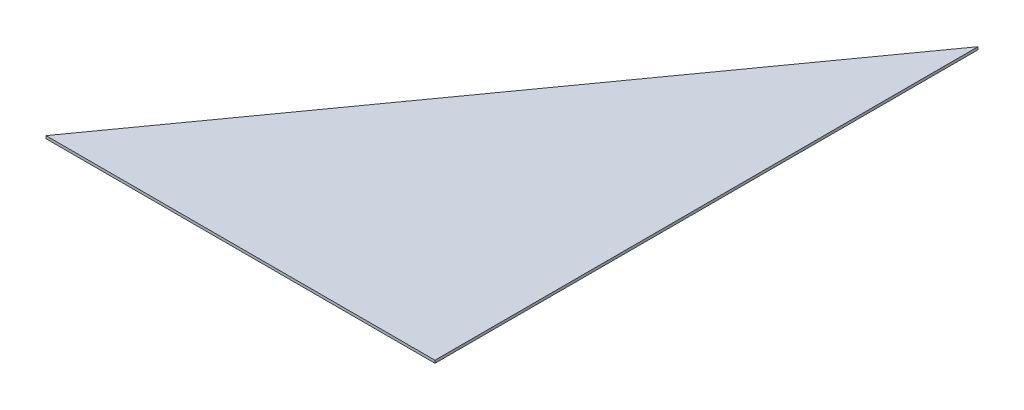
ISO-10303-21;
HEADER;
FILE_DESCRIPTION(('STEP AP214'),'2;1');
FILE_NAME('part.step','',(''),(''),'','','');
FILE_SCHEMA(('AUTOMOTIVE_DESIGN { 1 0 10303 214 1 1 1 1 }'));
ENDSEC;
DATA;
#1=APPLICATION_CONTEXT('core data for automotive mechanical design processes');
#2=APPLICATION_PROTOCOL_DEFINITION('international standard','automotive_design',2000,#1);
#3=PRODUCT_CONTEXT('',#1,'mechanical');
#4=PRODUCT('Part','Part','',(#3));
#5=PRODUCT_RELATED_PRODUCT_CATEGORY('part','',(#4));
#6=PRODUCT_DEFINITION_FORMATION('','',#4);
#7=PRODUCT_DEFINITION_CONTEXT('part definition',#1,'design');
#8=PRODUCT_DEFINITION('design','',#6,#7);
#9=PRODUCT_DEFINITION_SHAPE('','',#8);
#10=(LENGTH_UNIT() NAMED_UNIT(*) SI_UNIT(.MILLI.,.METRE.));
#11=(NAMED_UNIT(*) PLANE_ANGLE_UNIT() SI_UNIT($,.RADIAN.));
#12=(NAMED_UNIT(*) SI_UNIT($,.STERADIAN.) SOLID_ANGLE_UNIT());
#13=UNCERTAINTY_MEASURE_WITH_UNIT(LENGTH_MEASURE(1.E-05),#10,'distance_accuracy_value','');
#14=(GEOMETRIC_REPRESENTATION_CONTEXT(3) GLOBAL_UNCERTAINTY_ASSIGNED_CONTEXT((#13)) GLOBAL_UNIT_ASSIGNED_CONTEXT((#10,
#11,#12)) REPRESENTATION_CONTEXT('',''));
#15=CARTESIAN_POINT('',(0.,0.,0.));
#16=DIRECTION('',(0.,0.,1.));
#17=DIRECTION('',(1.,0.,0.));
#18=AXIS2_PLACEMENT_3D('',#15,#16,#17);
#19=CARTESIAN_POINT('',(228.52788084608,1.5875,0.));
#20=DIRECTION('',(0.,0.,-1.));
#21=DIRECTION('',(-1.,0.,0.));
#22=AXIS2_PLACEMENT_3D('',#19,#20,#21);
#23=PLANE('',#22);
#24=DIRECTION('',(1.,0.,0.));
#25=VECTOR('',#24,1.);
#26=CARTESIAN_POINT('',(228.52788084608,0.,0.));
#27=LINE('',#26,#25);
#28=CARTESIAN_POINT('',(0.,0.,0.));
#29=VERTEX_POINT('',#28);
#30=CARTESIAN_POINT('',(228.52788084608,0.,0.));
#31=VERTEX_POINT('',#30);
#32=EDGE_CURVE('E80',#29,#31,#27,.T.);
#33=ORIENTED_EDGE('',*,*,#32,.T.);
#34=DIRECTION('',(0.,-1.,0.));
#35=VECTOR('',#34,1.);
#36=CARTESIAN_POINT('',(228.52788084608,1.5875,0.));
#37=LINE('',#36,#35);
#38=CARTESIAN_POINT('',(228.52788084608,1.5875,0.));
#39=VERTEX_POINT('',#38);
#40=EDGE_CURVE('E11',#39,#31,#37,.T.);
#41=ORIENTED_EDGE('',*,*,#40,.F.);
#42=DIRECTION('',(1.,0.,0.));
#43=VECTOR('',#42,1.);
#44=CARTESIAN_POINT('',(228.52788084608,1.5875,0.));
#45=LINE('',#44,#43);
#46=CARTESIAN_POINT('',(0.,1.5875,0.));
#47=VERTEX_POINT('',#46);
#48=EDGE_CURVE('E73',#47,#39,#45,.T.);
#49=ORIENTED_EDGE('',*,*,#48,.F.);
#50=DIRECTION('',(0.,-1.,0.));
#51=VECTOR('',#50,1.);
#52=CARTESIAN_POINT('',(0.,1.5875,0.));
#53=LINE('',#52,#51);
#54=EDGE_CURVE('E81',#47,#29,#53,.T.);
#55=ORIENTED_EDGE('',*,*,#54,.T.);
#56=EDGE_LOOP('',(#33,#41,#49,#55));
#57=FACE_BOUND('',#56,.T.);
#58=ADVANCED_FACE('F33',(#57),#23,.F.);
#59=CARTESIAN_POINT('',(228.52788084608,1.5875,-319.024));
#60=DIRECTION('',(-1.,0.,0.));
#61=DIRECTION('',(0.,0.,1.));
#62=AXIS2_PLACEMENT_3D('',#59,#60,#61);
#63=PLANE('',#62);
#64=DIRECTION('',(0.,0.,-1.));
#65=VECTOR('',#64,1.);
#66=CARTESIAN_POINT('',(228.52788084608,0.,-319.024));
#67=LINE('',#66,#65);
#68=CARTESIAN_POINT('',(228.52788084608,0.,-319.024));
#69=VERTEX_POINT('',#68);
#70=EDGE_CURVE('E61',#31,#69,#67,.T.);
#71=ORIENTED_EDGE('',*,*,#70,.T.);
#72=DIRECTION('',(0.,-1.,0.));
#73=VECTOR('',#72,1.);
#74=CARTESIAN_POINT('',(228.52788084608,1.5875,-319.024));
#75=LINE('',#74,#73);
#76=CARTESIAN_POINT('',(228.52788084608,1.5875,-319.024));
#77=VERTEX_POINT('',#76);
#78=EDGE_CURVE('E41',#77,#69,#75,.T.);
#79=ORIENTED_EDGE('',*,*,#78,.F.);
#80=DIRECTION('',(0.,0.,-1.));
#81=VECTOR('',#80,1.);
#82=CARTESIAN_POINT('',(228.52788084608,1.5875,-319.024));
#83=LINE('',#82,#81);
#84=EDGE_CURVE('E69',#39,#77,#83,.T.);
#85=ORIENTED_EDGE('',*,*,#84,.F.);
#86=ORIENTED_EDGE('',*,*,#40,.T.);
#87=EDGE_LOOP('',(#71,#79,#85,#86));
#88=FACE_BOUND('',#87,.T.);
#89=ADVANCED_FACE('F70',(#88),#63,.F.);
#90=CARTESIAN_POINT('',(0.,1.5875,0.));
#91=DIRECTION('',(0.81294498381877,0.,0.582340496002038));
#92=DIRECTION('',(0.582340496002038,0.,-0.81294498381877));
#93=AXIS2_PLACEMENT_3D('',#90,#91,#92);
#94=PLANE('',#93);
#95=DIRECTION('',(-0.582340496002038,0.,0.81294498381877));
#96=VECTOR('',#95,1.);
#97=CARTESIAN_POINT('',(0.,0.,0.));
#98=LINE('',#97,#96);
#99=EDGE_CURVE('E66',#69,#29,#98,.T.);
#100=ORIENTED_EDGE('',*,*,#99,.T.);
#101=ORIENTED_EDGE('',*,*,#54,.F.);
#102=DIRECTION('',(-0.582340496002038,0.,0.81294498381877));
#103=VECTOR('',#102,1.);
#104=CARTESIAN_POINT('',(0.,1.5875,0.));
#105=LINE('',#104,#103);
#106=EDGE_CURVE('E49',#77,#47,#105,.T.);
#107=ORIENTED_EDGE('',*,*,#106,.F.);
#108=ORIENTED_EDGE('',*,*,#78,.T.);
#109=EDGE_LOOP('',(#100,#101,#107,#108));
#110=FACE_BOUND('',#109,.T.);
#111=ADVANCED_FACE('F88',(#110),#94,.F.);
#112=CARTESIAN_POINT('',(0.,1.5875,0.));
#113=DIRECTION('',(0.,1.,0.));
#114=DIRECTION('',(0.,0.,1.));
#115=AXIS2_PLACEMENT_3D('',#112,#113,#114);
#116=PLANE('',#115);
#117=ORIENTED_EDGE('',*,*,#48,.T.);
#118=ORIENTED_EDGE('',*,*,#84,.T.);
#119=ORIENTED_EDGE('',*,*,#106,.T.);
#120=EDGE_LOOP('',(#117,#118,#119));
#121=FACE_BOUND('',#120,.T.);
#122=ADVANCED_FACE('F76',(#121),#116,.T.);
#123=CARTESIAN_POINT('',(0.,0.,0.));
#124=DIRECTION('',(0.,1.,0.));
#125=DIRECTION('',(0.,0.,1.));
#126=AXIS2_PLACEMENT_3D('',#123,#124,#125);
#127=PLANE('',#126);
#128=ORIENTED_EDGE('',*,*,#32,.F.);
#129=ORIENTED_EDGE('',*,*,#99,.F.);
#130=ORIENTED_EDGE('',*,*,#70,.F.);
#131=EDGE_LOOP('',(#128,#129,#130));
#132=FACE_BOUND('',#131,.T.);
#133=ADVANCED_FACE('F89',(#132),#127,.F.);
#134=CLOSED_SHELL('',(#58,#89,#111,#122,#133));
#135=MANIFOLD_SOLID_BREP('B2',#134);
#136=ADVANCED_BREP_SHAPE_REPRESENTATION('',(#18,#135),#14);
#137=SHAPE_DEFINITION_REPRESENTATION(#9,#136);
ENDSEC;
END-ISO-10303-21;
